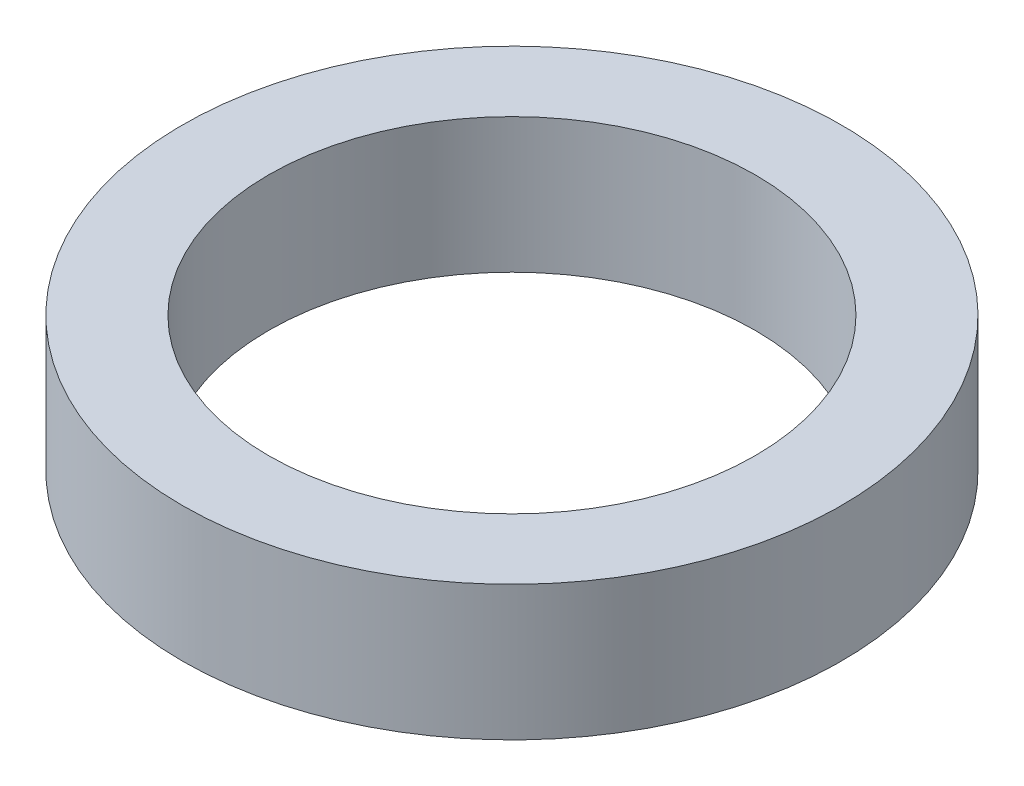
ISO-10303-21;
HEADER;
FILE_DESCRIPTION(('STEP AP214'),'2;1');
FILE_NAME('part.step','',(''),(''),'','','');
FILE_SCHEMA(('AUTOMOTIVE_DESIGN { 1 0 10303 214 1 1 1 1 }'));
ENDSEC;
DATA;
#1=APPLICATION_CONTEXT('core data for automotive mechanical design processes');
#2=APPLICATION_PROTOCOL_DEFINITION('international standard','automotive_design',2000,#1);
#3=PRODUCT_CONTEXT('',#1,'mechanical');
#4=PRODUCT('Part','Part','',(#3));
#5=PRODUCT_RELATED_PRODUCT_CATEGORY('part','',(#4));
#6=PRODUCT_DEFINITION_FORMATION('','',#4);
#7=PRODUCT_DEFINITION_CONTEXT('part definition',#1,'design');
#8=PRODUCT_DEFINITION('design','',#6,#7);
#9=PRODUCT_DEFINITION_SHAPE('','',#8);
#10=(LENGTH_UNIT() NAMED_UNIT(*) SI_UNIT(.MILLI.,.METRE.));
#11=(NAMED_UNIT(*) PLANE_ANGLE_UNIT() SI_UNIT($,.RADIAN.));
#12=(NAMED_UNIT(*) SI_UNIT($,.STERADIAN.) SOLID_ANGLE_UNIT());
#13=UNCERTAINTY_MEASURE_WITH_UNIT(LENGTH_MEASURE(1.E-05),#10,'distance_accuracy_value','');
#14=(GEOMETRIC_REPRESENTATION_CONTEXT(3) GLOBAL_UNCERTAINTY_ASSIGNED_CONTEXT((#13)) GLOBAL_UNIT_ASSIGNED_CONTEXT((#10,
#11,#12)) REPRESENTATION_CONTEXT('',''));
#15=CARTESIAN_POINT('',(0.,0.,0.));
#16=DIRECTION('',(0.,0.,1.));
#17=DIRECTION('',(1.,0.,0.));
#18=AXIS2_PLACEMENT_3D('',#15,#16,#17);
#19=CARTESIAN_POINT('',(0.,5.71246,0.));
#20=DIRECTION('',(0.,1.,0.));
#21=DIRECTION('',(0.,0.,1.));
#22=AXIS2_PLACEMENT_3D('',#19,#20,#21);
#23=PLANE('',#22);
#24=CARTESIAN_POINT('',(0.,5.71246,0.));
#25=DIRECTION('',(0.,1.,0.));
#26=DIRECTION('',(0.,0.,1.));
#27=AXIS2_PLACEMENT_3D('',#24,#25,#26);
#28=CIRCLE('',#27,13.97);
#29=CARTESIAN_POINT('',(0.,5.71246,13.97));
#30=VERTEX_POINT('',#29);
#31=EDGE_CURVE('E10',#30,#30,#28,.T.);
#32=ORIENTED_EDGE('',*,*,#31,.T.);
#33=EDGE_LOOP('',(#32));
#34=FACE_BOUND('',#33,.T.);
#35=CARTESIAN_POINT('',(0.,5.71246,0.));
#36=DIRECTION('',(0.,1.,0.));
#37=DIRECTION('',(0.,0.,1.));
#38=AXIS2_PLACEMENT_3D('',#35,#36,#37);
#39=CIRCLE('',#38,10.3124);
#40=CARTESIAN_POINT('',(0.,5.71246,10.3124));
#41=VERTEX_POINT('',#40);
#42=EDGE_CURVE('E42',#41,#41,#39,.T.);
#43=ORIENTED_EDGE('',*,*,#42,.F.);
#44=EDGE_LOOP('',(#43));
#45=FACE_BOUND('',#44,.T.);
#46=ADVANCED_FACE('F31',(#34,#45),#23,.T.);
#47=CARTESIAN_POINT('',(0.,0.,0.));
#48=DIRECTION('',(0.,1.,0.));
#49=DIRECTION('',(0.,0.,1.));
#50=AXIS2_PLACEMENT_3D('',#47,#48,#49);
#51=PLANE('',#50);
#52=CARTESIAN_POINT('',(0.,0.,0.));
#53=DIRECTION('',(0.,1.,0.));
#54=DIRECTION('',(0.,0.,1.));
#55=AXIS2_PLACEMENT_3D('',#52,#53,#54);
#56=CIRCLE('',#55,13.97);
#57=CARTESIAN_POINT('',(0.,0.,13.97));
#58=VERTEX_POINT('',#57);
#59=EDGE_CURVE('E35',#58,#58,#56,.T.);
#60=ORIENTED_EDGE('',*,*,#59,.F.);
#61=EDGE_LOOP('',(#60));
#62=FACE_BOUND('',#61,.T.);
#63=CARTESIAN_POINT('',(0.,0.,0.));
#64=DIRECTION('',(0.,1.,0.));
#65=DIRECTION('',(0.,0.,1.));
#66=AXIS2_PLACEMENT_3D('',#63,#64,#65);
#67=CIRCLE('',#66,10.3124);
#68=CARTESIAN_POINT('',(0.,0.,10.3124));
#69=VERTEX_POINT('',#68);
#70=EDGE_CURVE('E44',#69,#69,#67,.T.);
#71=ORIENTED_EDGE('',*,*,#70,.T.);
#72=EDGE_LOOP('',(#71));
#73=FACE_BOUND('',#72,.T.);
#74=ADVANCED_FACE('F54',(#62,#73),#51,.F.);
#75=CARTESIAN_POINT('',(0.,5.71246,0.));
#76=DIRECTION('',(0.,-1.,0.));
#77=DIRECTION('',(0.,0.,-1.));
#78=AXIS2_PLACEMENT_3D('',#75,#76,#77);
#79=CYLINDRICAL_SURFACE('',#78,13.97);
#80=ORIENTED_EDGE('',*,*,#31,.F.);
#81=EDGE_LOOP('',(#80));
#82=FACE_BOUND('',#81,.T.);
#83=ORIENTED_EDGE('',*,*,#59,.T.);
#84=EDGE_LOOP('',(#83));
#85=FACE_BOUND('',#84,.T.);
#86=ADVANCED_FACE('F33',(#82,#85),#79,.T.);
#87=CARTESIAN_POINT('',(0.,5.71246,0.));
#88=DIRECTION('',(0.,-1.,0.));
#89=DIRECTION('',(0.,0.,-1.));
#90=AXIS2_PLACEMENT_3D('',#87,#88,#89);
#91=CYLINDRICAL_SURFACE('',#90,10.3124);
#92=ORIENTED_EDGE('',*,*,#42,.T.);
#93=EDGE_LOOP('',(#92));
#94=FACE_BOUND('',#93,.T.);
#95=ORIENTED_EDGE('',*,*,#70,.F.);
#96=EDGE_LOOP('',(#95));
#97=FACE_BOUND('',#96,.T.);
#98=ADVANCED_FACE('F50',(#94,#97),#91,.F.);
#99=CLOSED_SHELL('',(#46,#74,#86,#98));
#100=MANIFOLD_SOLID_BREP('B2',#99);
#101=ADVANCED_BREP_SHAPE_REPRESENTATION('',(#18,#100),#14);
#102=SHAPE_DEFINITION_REPRESENTATION(#9,#101);
ENDSEC;
END-ISO-10303-21;
